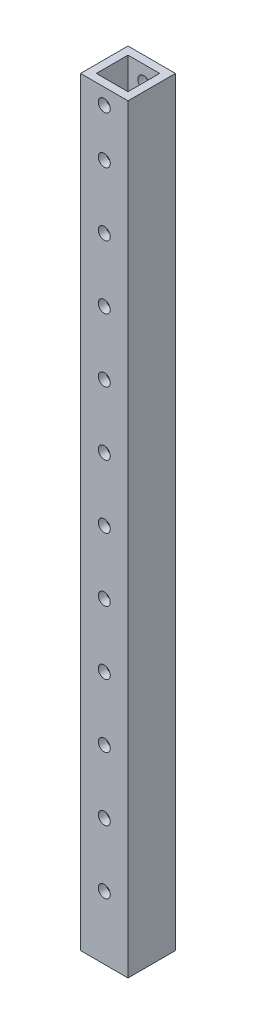
ISO-10303-21;
HEADER;
FILE_DESCRIPTION(('STEP AP214'),'2;1');
FILE_NAME('part.step','',(''),(''),'','','');
FILE_SCHEMA(('AUTOMOTIVE_DESIGN { 1 0 10303 214 1 1 1 1 }'));
ENDSEC;
DATA;
#1=APPLICATION_CONTEXT('core data for automotive mechanical design processes');
#2=APPLICATION_PROTOCOL_DEFINITION('international standard','automotive_design',2000,#1);
#3=PRODUCT_CONTEXT('',#1,'mechanical');
#4=PRODUCT('Part','Part','',(#3));
#5=PRODUCT_RELATED_PRODUCT_CATEGORY('part','',(#4));
#6=PRODUCT_DEFINITION_FORMATION('','',#4);
#7=PRODUCT_DEFINITION_CONTEXT('part definition',#1,'design');
#8=PRODUCT_DEFINITION('design','',#6,#7);
#9=PRODUCT_DEFINITION_SHAPE('','',#8);
#10=(LENGTH_UNIT() NAMED_UNIT(*) SI_UNIT(.MILLI.,.METRE.));
#11=(NAMED_UNIT(*) PLANE_ANGLE_UNIT() SI_UNIT($,.RADIAN.));
#12=(NAMED_UNIT(*) SI_UNIT($,.STERADIAN.) SOLID_ANGLE_UNIT());
#13=UNCERTAINTY_MEASURE_WITH_UNIT(LENGTH_MEASURE(1.E-05),#10,'distance_accuracy_value','');
#14=(GEOMETRIC_REPRESENTATION_CONTEXT(3) GLOBAL_UNCERTAINTY_ASSIGNED_CONTEXT((#13)) GLOBAL_UNIT_ASSIGNED_CONTEXT((#10,
#11,#12)) REPRESENTATION_CONTEXT('',''));
#15=CARTESIAN_POINT('',(0.,0.,0.));
#16=DIRECTION('',(0.,0.,1.));
#17=DIRECTION('',(1.,0.,0.));
#18=AXIS2_PLACEMENT_3D('',#15,#16,#17);
#19=CARTESIAN_POINT('',(0.,609.6,0.));
#20=DIRECTION('',(0.,-1.,0.));
#21=DIRECTION('',(0.,0.,-1.));
#22=AXIS2_PLACEMENT_3D('',#19,#20,#21);
#23=PLANE('',#22);
#24=DIRECTION('',(0.,0.,-1.));
#25=VECTOR('',#24,1.);
#26=CARTESIAN_POINT('',(19.05,609.6,19.05));
#27=LINE('',#26,#25);
#28=CARTESIAN_POINT('',(19.05,609.6,19.05));
#29=VERTEX_POINT('',#28);
#30=CARTESIAN_POINT('',(19.05,609.6,-19.05));
#31=VERTEX_POINT('',#30);
#32=EDGE_CURVE('E138',#29,#31,#27,.T.);
#33=ORIENTED_EDGE('',*,*,#32,.T.);
#34=DIRECTION('',(-1.,0.,0.));
#35=VECTOR('',#34,1.);
#36=CARTESIAN_POINT('',(-19.05,609.6,-19.05));
#37=LINE('',#36,#35);
#38=CARTESIAN_POINT('',(-19.05,609.6,-19.05));
#39=VERTEX_POINT('',#38);
#40=EDGE_CURVE('E141',#31,#39,#37,.T.);
#41=ORIENTED_EDGE('',*,*,#40,.T.);
#42=DIRECTION('',(0.,0.,1.));
#43=VECTOR('',#42,1.);
#44=CARTESIAN_POINT('',(-19.05,609.6,19.05));
#45=LINE('',#44,#43);
#46=CARTESIAN_POINT('',(-19.05,609.6,19.05));
#47=VERTEX_POINT('',#46);
#48=EDGE_CURVE('E144',#39,#47,#45,.T.);
#49=ORIENTED_EDGE('',*,*,#48,.T.);
#50=DIRECTION('',(1.,0.,0.));
#51=VECTOR('',#50,1.);
#52=CARTESIAN_POINT('',(-19.05,609.6,19.05));
#53=LINE('',#52,#51);
#54=EDGE_CURVE('E146',#47,#29,#53,.T.);
#55=ORIENTED_EDGE('',*,*,#54,.T.);
#56=EDGE_LOOP('',(#33,#41,#49,#55));
#57=FACE_BOUND('',#56,.T.);
#58=DIRECTION('',(0.,0.,-1.));
#59=VECTOR('',#58,1.);
#60=CARTESIAN_POINT('',(12.7,609.6,12.7));
#61=LINE('',#60,#59);
#62=CARTESIAN_POINT('',(12.7,609.6,12.7));
#63=VERTEX_POINT('',#62);
#64=CARTESIAN_POINT('',(12.7,609.6,-12.7));
#65=VERTEX_POINT('',#64);
#66=EDGE_CURVE('E100',#63,#65,#61,.T.);
#67=ORIENTED_EDGE('',*,*,#66,.F.);
#68=DIRECTION('',(1.,0.,0.));
#69=VECTOR('',#68,1.);
#70=CARTESIAN_POINT('',(-12.7,609.6,12.7));
#71=LINE('',#70,#69);
#72=CARTESIAN_POINT('',(-12.7,609.6,12.7));
#73=VERTEX_POINT('',#72);
#74=EDGE_CURVE('E122',#73,#63,#71,.T.);
#75=ORIENTED_EDGE('',*,*,#74,.F.);
#76=DIRECTION('',(0.,0.,1.));
#77=VECTOR('',#76,1.);
#78=CARTESIAN_POINT('',(-12.7,609.6,12.7));
#79=LINE('',#78,#77);
#80=CARTESIAN_POINT('',(-12.7,609.6,-12.7));
#81=VERTEX_POINT('',#80);
#82=EDGE_CURVE('E120',#81,#73,#79,.T.);
#83=ORIENTED_EDGE('',*,*,#82,.F.);
#84=DIRECTION('',(-1.,0.,0.));
#85=VECTOR('',#84,1.);
#86=CARTESIAN_POINT('',(-12.7,609.6,-12.7));
#87=LINE('',#86,#85);
#88=EDGE_CURVE('E108',#65,#81,#87,.T.);
#89=ORIENTED_EDGE('',*,*,#88,.F.);
#90=EDGE_LOOP('',(#67,#75,#83,#89));
#91=FACE_BOUND('',#90,.T.);
#92=ADVANCED_FACE('F33',(#57,#91),#23,.F.);
#93=CARTESIAN_POINT('',(0.,0.,0.));
#94=DIRECTION('',(0.,-1.,0.));
#95=DIRECTION('',(0.,0.,-1.));
#96=AXIS2_PLACEMENT_3D('',#93,#94,#95);
#97=PLANE('',#96);
#98=DIRECTION('',(0.,0.,-1.));
#99=VECTOR('',#98,1.);
#100=CARTESIAN_POINT('',(19.05,0.,19.05));
#101=LINE('',#100,#99);
#102=CARTESIAN_POINT('',(19.05,0.,19.05));
#103=VERTEX_POINT('',#102);
#104=CARTESIAN_POINT('',(19.05,0.,-19.05));
#105=VERTEX_POINT('',#104);
#106=EDGE_CURVE('E116',#103,#105,#101,.T.);
#107=ORIENTED_EDGE('',*,*,#106,.F.);
#108=DIRECTION('',(1.,0.,0.));
#109=VECTOR('',#108,1.);
#110=CARTESIAN_POINT('',(-19.05,0.,19.05));
#111=LINE('',#110,#109);
#112=CARTESIAN_POINT('',(-19.05,0.,19.05));
#113=VERTEX_POINT('',#112);
#114=EDGE_CURVE('E142',#113,#103,#111,.T.);
#115=ORIENTED_EDGE('',*,*,#114,.F.);
#116=DIRECTION('',(0.,0.,1.));
#117=VECTOR('',#116,1.);
#118=CARTESIAN_POINT('',(-19.05,0.,19.05));
#119=LINE('',#118,#117);
#120=CARTESIAN_POINT('',(-19.05,0.,-19.05));
#121=VERTEX_POINT('',#120);
#122=EDGE_CURVE('E153',#121,#113,#119,.T.);
#123=ORIENTED_EDGE('',*,*,#122,.F.);
#124=DIRECTION('',(-1.,0.,0.));
#125=VECTOR('',#124,1.);
#126=CARTESIAN_POINT('',(-19.05,0.,-19.05));
#127=LINE('',#126,#125);
#128=EDGE_CURVE('E151',#105,#121,#127,.T.);
#129=ORIENTED_EDGE('',*,*,#128,.F.);
#130=EDGE_LOOP('',(#107,#115,#123,#129));
#131=FACE_BOUND('',#130,.T.);
#132=DIRECTION('',(1.,0.,0.));
#133=VECTOR('',#132,1.);
#134=CARTESIAN_POINT('',(-12.7,0.,12.7));
#135=LINE('',#134,#133);
#136=CARTESIAN_POINT('',(-12.7,0.,12.7));
#137=VERTEX_POINT('',#136);
#138=CARTESIAN_POINT('',(12.7,0.,12.7));
#139=VERTEX_POINT('',#138);
#140=EDGE_CURVE('E109',#137,#139,#135,.T.);
#141=ORIENTED_EDGE('',*,*,#140,.T.);
#142=DIRECTION('',(0.,0.,-1.));
#143=VECTOR('',#142,1.);
#144=CARTESIAN_POINT('',(12.7,0.,12.7));
#145=LINE('',#144,#143);
#146=CARTESIAN_POINT('',(12.7,0.,-12.7));
#147=VERTEX_POINT('',#146);
#148=EDGE_CURVE('E58',#139,#147,#145,.T.);
#149=ORIENTED_EDGE('',*,*,#148,.T.);
#150=DIRECTION('',(-1.,0.,0.));
#151=VECTOR('',#150,1.);
#152=CARTESIAN_POINT('',(-12.7,0.,-12.7));
#153=LINE('',#152,#151);
#154=CARTESIAN_POINT('',(-12.7,0.,-12.7));
#155=VERTEX_POINT('',#154);
#156=EDGE_CURVE('E115',#147,#155,#153,.T.);
#157=ORIENTED_EDGE('',*,*,#156,.T.);
#158=DIRECTION('',(0.,0.,1.));
#159=VECTOR('',#158,1.);
#160=CARTESIAN_POINT('',(-12.7,0.,12.7));
#161=LINE('',#160,#159);
#162=EDGE_CURVE('E130',#155,#137,#161,.T.);
#163=ORIENTED_EDGE('',*,*,#162,.T.);
#164=EDGE_LOOP('',(#141,#149,#157,#163));
#165=FACE_BOUND('',#164,.T.);
#166=ADVANCED_FACE('F256',(#131,#165),#97,.T.);
#167=CARTESIAN_POINT('',(19.05,609.6,19.05));
#168=DIRECTION('',(-1.,0.,0.));
#169=DIRECTION('',(0.,0.,1.));
#170=AXIS2_PLACEMENT_3D('',#167,#168,#169);
#171=PLANE('',#170);
#172=ORIENTED_EDGE('',*,*,#106,.T.);
#173=DIRECTION('',(0.,-1.,0.));
#174=VECTOR('',#173,1.);
#175=CARTESIAN_POINT('',(19.05,609.6,-19.05));
#176=LINE('',#175,#174);
#177=EDGE_CURVE('E11',#31,#105,#176,.T.);
#178=ORIENTED_EDGE('',*,*,#177,.F.);
#179=ORIENTED_EDGE('',*,*,#32,.F.);
#180=DIRECTION('',(0.,-1.,0.));
#181=VECTOR('',#180,1.);
#182=CARTESIAN_POINT('',(19.05,609.6,19.05));
#183=LINE('',#182,#181);
#184=EDGE_CURVE('E148',#29,#103,#183,.T.);
#185=ORIENTED_EDGE('',*,*,#184,.T.);
#186=EDGE_LOOP('',(#172,#178,#179,#185));
#187=FACE_BOUND('',#186,.T.);
#188=ADVANCED_FACE('F35',(#187),#171,.F.);
#189=CARTESIAN_POINT('',(-19.05,609.6,-19.05));
#190=DIRECTION('',(0.,0.,1.));
#191=DIRECTION('',(1.,0.,0.));
#192=AXIS2_PLACEMENT_3D('',#189,#190,#191);
#193=PLANE('',#192);
#194=CARTESIAN_POINT('',(0.,596.9,-19.05));
#195=DIRECTION('',(0.,0.,1.));
#196=DIRECTION('',(1.,0.,0.));
#197=AXIS2_PLACEMENT_3D('',#194,#195,#196);
#198=CIRCLE('',#197,4.82600000000001);
#199=CARTESIAN_POINT('',(4.82600000000001,596.9,-19.05));
#200=VERTEX_POINT('',#199);
#201=EDGE_CURVE('E128',#200,#200,#198,.T.);
#202=ORIENTED_EDGE('',*,*,#201,.T.);
#203=EDGE_LOOP('',(#202));
#204=FACE_BOUND('',#203,.T.);
#205=CARTESIAN_POINT('',(0.,558.8,-19.05));
#206=DIRECTION('',(0.,0.,1.));
#207=DIRECTION('',(1.,0.,0.));
#208=AXIS2_PLACEMENT_3D('',#205,#206,#207);
#209=CIRCLE('',#208,4.82600000000001);
#210=CARTESIAN_POINT('',(4.82600000000001,558.8,-19.05));
#211=VERTEX_POINT('',#210);
#212=EDGE_CURVE('E219',#211,#211,#209,.T.);
#213=ORIENTED_EDGE('',*,*,#212,.T.);
#214=EDGE_LOOP('',(#213));
#215=FACE_BOUND('',#214,.T.);
#216=CARTESIAN_POINT('',(5.28991153169859E-13,508.,-19.05));
#217=DIRECTION('',(0.,0.,1.));
#218=DIRECTION('',(1.,0.,0.));
#219=AXIS2_PLACEMENT_3D('',#216,#217,#218);
#220=CIRCLE('',#219,4.82600000000001);
#221=CARTESIAN_POINT('',(4.82600000000054,508.,-19.05));
#222=VERTEX_POINT('',#221);
#223=EDGE_CURVE('E215',#222,#222,#220,.T.);
#224=ORIENTED_EDGE('',*,*,#223,.T.);
#225=EDGE_LOOP('',(#224));
#226=FACE_BOUND('',#225,.T.);
#227=CARTESIAN_POINT('',(1.05798230633972E-12,457.2,-19.05));
#228=DIRECTION('',(0.,0.,1.));
#229=DIRECTION('',(1.,0.,0.));
#230=AXIS2_PLACEMENT_3D('',#227,#228,#229);
#231=CIRCLE('',#230,4.82600000000001);
#232=CARTESIAN_POINT('',(4.82600000000107,457.2,-19.05));
#233=VERTEX_POINT('',#232);
#234=EDGE_CURVE('E211',#233,#233,#231,.T.);
#235=ORIENTED_EDGE('',*,*,#234,.T.);
#236=EDGE_LOOP('',(#235));
#237=FACE_BOUND('',#236,.T.);
#238=CARTESIAN_POINT('',(1.58697345950958E-12,406.4,-19.05));
#239=DIRECTION('',(0.,0.,1.));
#240=DIRECTION('',(1.,0.,0.));
#241=AXIS2_PLACEMENT_3D('',#238,#239,#240);
#242=CIRCLE('',#241,4.82600000000001);
#243=CARTESIAN_POINT('',(4.8260000000016,406.4,-19.05));
#244=VERTEX_POINT('',#243);
#245=EDGE_CURVE('E207',#244,#244,#242,.T.);
#246=ORIENTED_EDGE('',*,*,#245,.T.);
#247=EDGE_LOOP('',(#246));
#248=FACE_BOUND('',#247,.T.);
#249=CARTESIAN_POINT('',(2.11596461267944E-12,355.6,-19.05));
#250=DIRECTION('',(0.,0.,1.));
#251=DIRECTION('',(1.,0.,0.));
#252=AXIS2_PLACEMENT_3D('',#249,#250,#251);
#253=CIRCLE('',#252,4.82600000000001);
#254=CARTESIAN_POINT('',(4.82600000000213,355.6,-19.05));
#255=VERTEX_POINT('',#254);
#256=EDGE_CURVE('E202',#255,#255,#253,.T.);
#257=ORIENTED_EDGE('',*,*,#256,.T.);
#258=EDGE_LOOP('',(#257));
#259=FACE_BOUND('',#258,.T.);
#260=CARTESIAN_POINT('',(2.6449557658493E-12,304.8,-19.05));
#261=DIRECTION('',(0.,0.,1.));
#262=DIRECTION('',(1.,0.,0.));
#263=AXIS2_PLACEMENT_3D('',#260,#261,#262);
#264=CIRCLE('',#263,4.82600000000001);
#265=CARTESIAN_POINT('',(4.82600000000266,304.8,-19.05));
#266=VERTEX_POINT('',#265);
#267=EDGE_CURVE('E197',#266,#266,#264,.T.);
#268=ORIENTED_EDGE('',*,*,#267,.T.);
#269=EDGE_LOOP('',(#268));
#270=FACE_BOUND('',#269,.T.);
#271=CARTESIAN_POINT('',(3.17394691901916E-12,254.,-19.05));
#272=DIRECTION('',(0.,0.,1.));
#273=DIRECTION('',(1.,0.,0.));
#274=AXIS2_PLACEMENT_3D('',#271,#272,#273);
#275=CIRCLE('',#274,4.82600000000001);
#276=CARTESIAN_POINT('',(4.82600000000319,254.,-19.05));
#277=VERTEX_POINT('',#276);
#278=EDGE_CURVE('E192',#277,#277,#275,.T.);
#279=ORIENTED_EDGE('',*,*,#278,.T.);
#280=EDGE_LOOP('',(#279));
#281=FACE_BOUND('',#280,.T.);
#282=CARTESIAN_POINT('',(3.70293807218901E-12,203.2,-19.05));
#283=DIRECTION('',(0.,0.,1.));
#284=DIRECTION('',(1.,0.,0.));
#285=AXIS2_PLACEMENT_3D('',#282,#283,#284);
#286=CIRCLE('',#285,4.82600000000001);
#287=CARTESIAN_POINT('',(4.82600000000371,203.2,-19.05));
#288=VERTEX_POINT('',#287);
#289=EDGE_CURVE('E187',#288,#288,#286,.T.);
#290=ORIENTED_EDGE('',*,*,#289,.T.);
#291=EDGE_LOOP('',(#290));
#292=FACE_BOUND('',#291,.T.);
#293=CARTESIAN_POINT('',(4.23192922535887E-12,152.4,-19.05));
#294=DIRECTION('',(0.,0.,1.));
#295=DIRECTION('',(1.,0.,0.));
#296=AXIS2_PLACEMENT_3D('',#293,#294,#295);
#297=CIRCLE('',#296,4.82600000000001);
#298=CARTESIAN_POINT('',(4.82600000000424,152.4,-19.05));
#299=VERTEX_POINT('',#298);
#300=EDGE_CURVE('E182',#299,#299,#297,.T.);
#301=ORIENTED_EDGE('',*,*,#300,.T.);
#302=EDGE_LOOP('',(#301));
#303=FACE_BOUND('',#302,.T.);
#304=CARTESIAN_POINT('',(4.76092037852873E-12,101.6,-19.05));
#305=DIRECTION('',(0.,0.,1.));
#306=DIRECTION('',(1.,0.,0.));
#307=AXIS2_PLACEMENT_3D('',#304,#305,#306);
#308=CIRCLE('',#307,4.82600000000001);
#309=CARTESIAN_POINT('',(4.82600000000477,101.6,-19.05));
#310=VERTEX_POINT('',#309);
#311=EDGE_CURVE('E177',#310,#310,#308,.T.);
#312=ORIENTED_EDGE('',*,*,#311,.T.);
#313=EDGE_LOOP('',(#312));
#314=FACE_BOUND('',#313,.T.);
#315=CARTESIAN_POINT('',(5.28991153169859E-12,50.8000000000001,-19.05));
#316=DIRECTION('',(0.,0.,1.));
#317=DIRECTION('',(1.,0.,0.));
#318=AXIS2_PLACEMENT_3D('',#315,#316,#317);
#319=CIRCLE('',#318,4.82600000000001);
#320=CARTESIAN_POINT('',(4.8260000000053,50.8000000000001,-19.05));
#321=VERTEX_POINT('',#320);
#322=EDGE_CURVE('E172',#321,#321,#319,.T.);
#323=ORIENTED_EDGE('',*,*,#322,.T.);
#324=EDGE_LOOP('',(#323));
#325=FACE_BOUND('',#324,.T.);
#326=ORIENTED_EDGE('',*,*,#128,.T.);
#327=DIRECTION('',(0.,-1.,0.));
#328=VECTOR('',#327,1.);
#329=CARTESIAN_POINT('',(-19.05,609.6,-19.05));
#330=LINE('',#329,#328);
#331=EDGE_CURVE('E42',#39,#121,#330,.T.);
#332=ORIENTED_EDGE('',*,*,#331,.F.);
#333=ORIENTED_EDGE('',*,*,#40,.F.);
#334=ORIENTED_EDGE('',*,*,#177,.T.);
#335=EDGE_LOOP('',(#326,#332,#333,#334));
#336=FACE_BOUND('',#335,.T.);
#337=ADVANCED_FACE('F236',(#204,#215,#226,#237,#248,#259,#270,#281,#292,#303,#314,#325,#336),
#193,.F.);
#338=CARTESIAN_POINT('',(-19.05,609.6,19.05));
#339=DIRECTION('',(1.,0.,0.));
#340=DIRECTION('',(0.,0.,-1.));
#341=AXIS2_PLACEMENT_3D('',#338,#339,#340);
#342=PLANE('',#341);
#343=ORIENTED_EDGE('',*,*,#122,.T.);
#344=DIRECTION('',(0.,-1.,0.));
#345=VECTOR('',#344,1.);
#346=CARTESIAN_POINT('',(-19.05,609.6,19.05));
#347=LINE('',#346,#345);
#348=EDGE_CURVE('E158',#47,#113,#347,.T.);
#349=ORIENTED_EDGE('',*,*,#348,.F.);
#350=ORIENTED_EDGE('',*,*,#48,.F.);
#351=ORIENTED_EDGE('',*,*,#331,.T.);
#352=EDGE_LOOP('',(#343,#349,#350,#351));
#353=FACE_BOUND('',#352,.T.);
#354=ADVANCED_FACE('F270',(#353),#342,.F.);
#355=CARTESIAN_POINT('',(-19.05,609.6,19.05));
#356=DIRECTION('',(0.,0.,-1.));
#357=DIRECTION('',(-1.,0.,0.));
#358=AXIS2_PLACEMENT_3D('',#355,#356,#357);
#359=PLANE('',#358);
#360=CARTESIAN_POINT('',(0.,596.9,19.05));
#361=DIRECTION('',(0.,0.,1.));
#362=DIRECTION('',(1.,0.,0.));
#363=AXIS2_PLACEMENT_3D('',#360,#361,#362);
#364=CIRCLE('',#363,4.82600000000001);
#365=CARTESIAN_POINT('',(4.82600000000001,596.9,19.05));
#366=VERTEX_POINT('',#365);
#367=EDGE_CURVE('E167',#366,#366,#364,.T.);
#368=ORIENTED_EDGE('',*,*,#367,.F.);
#369=EDGE_LOOP('',(#368));
#370=FACE_BOUND('',#369,.T.);
#371=CARTESIAN_POINT('',(0.,558.8,19.05));
#372=DIRECTION('',(0.,0.,1.));
#373=DIRECTION('',(1.,0.,0.));
#374=AXIS2_PLACEMENT_3D('',#371,#372,#373);
#375=CIRCLE('',#374,4.82600000000001);
#376=CARTESIAN_POINT('',(4.82600000000001,558.8,19.05));
#377=VERTEX_POINT('',#376);
#378=EDGE_CURVE('E420',#377,#377,#375,.T.);
#379=ORIENTED_EDGE('',*,*,#378,.F.);
#380=EDGE_LOOP('',(#379));
#381=FACE_BOUND('',#380,.T.);
#382=CARTESIAN_POINT('',(5.28991153169859E-13,508.,19.05));
#383=DIRECTION('',(0.,0.,1.));
#384=DIRECTION('',(1.,0.,0.));
#385=AXIS2_PLACEMENT_3D('',#382,#383,#384);
#386=CIRCLE('',#385,4.82600000000001);
#387=CARTESIAN_POINT('',(4.82600000000054,508.,19.05));
#388=VERTEX_POINT('',#387);
#389=EDGE_CURVE('E416',#388,#388,#386,.T.);
#390=ORIENTED_EDGE('',*,*,#389,.F.);
#391=EDGE_LOOP('',(#390));
#392=FACE_BOUND('',#391,.T.);
#393=CARTESIAN_POINT('',(1.05798230633972E-12,457.2,19.05));
#394=DIRECTION('',(0.,0.,1.));
#395=DIRECTION('',(1.,0.,0.));
#396=AXIS2_PLACEMENT_3D('',#393,#394,#395);
#397=CIRCLE('',#396,4.82600000000001);
#398=CARTESIAN_POINT('',(4.82600000000107,457.2,19.05));
#399=VERTEX_POINT('',#398);
#400=EDGE_CURVE('E414',#399,#399,#397,.T.);
#401=ORIENTED_EDGE('',*,*,#400,.F.);
#402=EDGE_LOOP('',(#401));
#403=FACE_BOUND('',#402,.T.);
#404=CARTESIAN_POINT('',(1.58697345950958E-12,406.4,19.05));
#405=DIRECTION('',(0.,0.,1.));
#406=DIRECTION('',(1.,0.,0.));
#407=AXIS2_PLACEMENT_3D('',#404,#405,#406);
#408=CIRCLE('',#407,4.82600000000001);
#409=CARTESIAN_POINT('',(4.8260000000016,406.4,19.05));
#410=VERTEX_POINT('',#409);
#411=EDGE_CURVE('E417',#410,#410,#408,.T.);
#412=ORIENTED_EDGE('',*,*,#411,.F.);
#413=EDGE_LOOP('',(#412));
#414=FACE_BOUND('',#413,.T.);
#415=CARTESIAN_POINT('',(2.11596461267944E-12,355.6,19.05));
#416=DIRECTION('',(0.,0.,1.));
#417=DIRECTION('',(1.,0.,0.));
#418=AXIS2_PLACEMENT_3D('',#415,#416,#417);
#419=CIRCLE('',#418,4.82600000000001);
#420=CARTESIAN_POINT('',(4.82600000000213,355.6,19.05));
#421=VERTEX_POINT('',#420);
#422=EDGE_CURVE('E423',#421,#421,#419,.T.);
#423=ORIENTED_EDGE('',*,*,#422,.F.);
#424=EDGE_LOOP('',(#423));
#425=FACE_BOUND('',#424,.T.);
#426=CARTESIAN_POINT('',(2.6449557658493E-12,304.8,19.05));
#427=DIRECTION('',(0.,0.,1.));
#428=DIRECTION('',(1.,0.,0.));
#429=AXIS2_PLACEMENT_3D('',#426,#427,#428);
#430=CIRCLE('',#429,4.82600000000001);
#431=CARTESIAN_POINT('',(4.82600000000266,304.8,19.05));
#432=VERTEX_POINT('',#431);
#433=EDGE_CURVE('E429',#432,#432,#430,.T.);
#434=ORIENTED_EDGE('',*,*,#433,.F.);
#435=EDGE_LOOP('',(#434));
#436=FACE_BOUND('',#435,.T.);
#437=CARTESIAN_POINT('',(3.17394691901916E-12,254.,19.05));
#438=DIRECTION('',(0.,0.,1.));
#439=DIRECTION('',(1.,0.,0.));
#440=AXIS2_PLACEMENT_3D('',#437,#438,#439);
#441=CIRCLE('',#440,4.82600000000001);
#442=CARTESIAN_POINT('',(4.82600000000319,254.,19.05));
#443=VERTEX_POINT('',#442);
#444=EDGE_CURVE('E432',#443,#443,#441,.T.);
#445=ORIENTED_EDGE('',*,*,#444,.F.);
#446=EDGE_LOOP('',(#445));
#447=FACE_BOUND('',#446,.T.);
#448=CARTESIAN_POINT('',(3.70293807218901E-12,203.2,19.05));
#449=DIRECTION('',(0.,0.,1.));
#450=DIRECTION('',(1.,0.,0.));
#451=AXIS2_PLACEMENT_3D('',#448,#449,#450);
#452=CIRCLE('',#451,4.82600000000001);
#453=CARTESIAN_POINT('',(4.82600000000371,203.2,19.05));
#454=VERTEX_POINT('',#453);
#455=EDGE_CURVE('E435',#454,#454,#452,.T.);
#456=ORIENTED_EDGE('',*,*,#455,.F.);
#457=EDGE_LOOP('',(#456));
#458=FACE_BOUND('',#457,.T.);
#459=CARTESIAN_POINT('',(4.23192922535887E-12,152.4,19.05));
#460=DIRECTION('',(0.,0.,1.));
#461=DIRECTION('',(1.,0.,0.));
#462=AXIS2_PLACEMENT_3D('',#459,#460,#461);
#463=CIRCLE('',#462,4.82600000000001);
#464=CARTESIAN_POINT('',(4.82600000000424,152.4,19.05));
#465=VERTEX_POINT('',#464);
#466=EDGE_CURVE('E438',#465,#465,#463,.T.);
#467=ORIENTED_EDGE('',*,*,#466,.F.);
#468=EDGE_LOOP('',(#467));
#469=FACE_BOUND('',#468,.T.);
#470=CARTESIAN_POINT('',(4.76092037852873E-12,101.6,19.05));
#471=DIRECTION('',(0.,0.,1.));
#472=DIRECTION('',(1.,0.,0.));
#473=AXIS2_PLACEMENT_3D('',#470,#471,#472);
#474=CIRCLE('',#473,4.82600000000001);
#475=CARTESIAN_POINT('',(4.82600000000477,101.6,19.05));
#476=VERTEX_POINT('',#475);
#477=EDGE_CURVE('E440',#476,#476,#474,.T.);
#478=ORIENTED_EDGE('',*,*,#477,.F.);
#479=EDGE_LOOP('',(#478));
#480=FACE_BOUND('',#479,.T.);
#481=CARTESIAN_POINT('',(5.28991153169859E-12,50.8000000000001,19.05));
#482=DIRECTION('',(0.,0.,1.));
#483=DIRECTION('',(1.,0.,0.));
#484=AXIS2_PLACEMENT_3D('',#481,#482,#483);
#485=CIRCLE('',#484,4.82600000000001);
#486=CARTESIAN_POINT('',(4.8260000000053,50.8000000000001,19.05));
#487=VERTEX_POINT('',#486);
#488=EDGE_CURVE('E355',#487,#487,#485,.T.);
#489=ORIENTED_EDGE('',*,*,#488,.F.);
#490=EDGE_LOOP('',(#489));
#491=FACE_BOUND('',#490,.T.);
#492=ORIENTED_EDGE('',*,*,#114,.T.);
#493=ORIENTED_EDGE('',*,*,#184,.F.);
#494=ORIENTED_EDGE('',*,*,#54,.F.);
#495=ORIENTED_EDGE('',*,*,#348,.T.);
#496=EDGE_LOOP('',(#492,#493,#494,#495));
#497=FACE_BOUND('',#496,.T.);
#498=ADVANCED_FACE('F267',(#370,#381,#392,#403,#414,#425,#436,#447,#458,#469,#480,#491,#497),
#359,.F.);
#499=CARTESIAN_POINT('',(12.7,609.6,12.7));
#500=DIRECTION('',(-1.,0.,0.));
#501=DIRECTION('',(0.,0.,1.));
#502=AXIS2_PLACEMENT_3D('',#499,#500,#501);
#503=PLANE('',#502);
#504=ORIENTED_EDGE('',*,*,#148,.F.);
#505=DIRECTION('',(0.,-1.,0.));
#506=VECTOR('',#505,1.);
#507=CARTESIAN_POINT('',(12.7,609.6,12.7));
#508=LINE('',#507,#506);
#509=EDGE_CURVE('E104',#63,#139,#508,.T.);
#510=ORIENTED_EDGE('',*,*,#509,.F.);
#511=ORIENTED_EDGE('',*,*,#66,.T.);
#512=DIRECTION('',(0.,-1.,0.));
#513=VECTOR('',#512,1.);
#514=CARTESIAN_POINT('',(12.7,609.6,-12.7));
#515=LINE('',#514,#513);
#516=EDGE_CURVE('E103',#65,#147,#515,.T.);
#517=ORIENTED_EDGE('',*,*,#516,.T.);
#518=EDGE_LOOP('',(#504,#510,#511,#517));
#519=FACE_BOUND('',#518,.T.);
#520=ADVANCED_FACE('F102',(#519),#503,.T.);
#521=CARTESIAN_POINT('',(-12.7,609.6,-12.7));
#522=DIRECTION('',(0.,0.,1.));
#523=DIRECTION('',(1.,0.,0.));
#524=AXIS2_PLACEMENT_3D('',#521,#522,#523);
#525=PLANE('',#524);
#526=CARTESIAN_POINT('',(0.,596.9,-12.7000000000002));
#527=DIRECTION('',(0.,0.,1.));
#528=DIRECTION('',(1.,0.,0.));
#529=AXIS2_PLACEMENT_3D('',#526,#527,#528);
#530=CIRCLE('',#529,4.82600000000001);
#531=CARTESIAN_POINT('',(4.82600000000001,596.9,-12.7000000000002));
#532=VERTEX_POINT('',#531);
#533=EDGE_CURVE('E231',#532,#532,#530,.T.);
#534=ORIENTED_EDGE('',*,*,#533,.F.);
#535=EDGE_LOOP('',(#534));
#536=FACE_BOUND('',#535,.T.);
#537=CARTESIAN_POINT('',(0.,558.8,-12.7000000000002));
#538=DIRECTION('',(0.,0.,1.));
#539=DIRECTION('',(1.,0.,0.));
#540=AXIS2_PLACEMENT_3D('',#537,#538,#539);
#541=CIRCLE('',#540,4.82600000000001);
#542=CARTESIAN_POINT('',(4.82600000000001,558.8,-12.7000000000002));
#543=VERTEX_POINT('',#542);
#544=EDGE_CURVE('E214',#543,#543,#541,.T.);
#545=ORIENTED_EDGE('',*,*,#544,.F.);
#546=EDGE_LOOP('',(#545));
#547=FACE_BOUND('',#546,.T.);
#548=CARTESIAN_POINT('',(5.28991153169859E-13,508.,-12.7000000000002));
#549=DIRECTION('',(0.,0.,1.));
#550=DIRECTION('',(1.,0.,0.));
#551=AXIS2_PLACEMENT_3D('',#548,#549,#550);
#552=CIRCLE('',#551,4.82600000000001);
#553=CARTESIAN_POINT('',(4.82600000000054,508.,-12.7000000000002));
#554=VERTEX_POINT('',#553);
#555=EDGE_CURVE('E210',#554,#554,#552,.T.);
#556=ORIENTED_EDGE('',*,*,#555,.F.);
#557=EDGE_LOOP('',(#556));
#558=FACE_BOUND('',#557,.T.);
#559=CARTESIAN_POINT('',(1.05798230633972E-12,457.2,-12.7000000000002));
#560=DIRECTION('',(0.,0.,1.));
#561=DIRECTION('',(1.,0.,0.));
#562=AXIS2_PLACEMENT_3D('',#559,#560,#561);
#563=CIRCLE('',#562,4.82600000000001);
#564=CARTESIAN_POINT('',(4.82600000000107,457.2,-12.7000000000002));
#565=VERTEX_POINT('',#564);
#566=EDGE_CURVE('E206',#565,#565,#563,.T.);
#567=ORIENTED_EDGE('',*,*,#566,.F.);
#568=EDGE_LOOP('',(#567));
#569=FACE_BOUND('',#568,.T.);
#570=CARTESIAN_POINT('',(1.58697345950958E-12,406.4,-12.7000000000002));
#571=DIRECTION('',(0.,0.,1.));
#572=DIRECTION('',(1.,0.,0.));
#573=AXIS2_PLACEMENT_3D('',#570,#571,#572);
#574=CIRCLE('',#573,4.82600000000001);
#575=CARTESIAN_POINT('',(4.8260000000016,406.4,-12.7000000000002));
#576=VERTEX_POINT('',#575);
#577=EDGE_CURVE('E201',#576,#576,#574,.T.);
#578=ORIENTED_EDGE('',*,*,#577,.F.);
#579=EDGE_LOOP('',(#578));
#580=FACE_BOUND('',#579,.T.);
#581=CARTESIAN_POINT('',(2.11596461267944E-12,355.6,-12.7000000000002));
#582=DIRECTION('',(0.,0.,1.));
#583=DIRECTION('',(1.,0.,0.));
#584=AXIS2_PLACEMENT_3D('',#581,#582,#583);
#585=CIRCLE('',#584,4.82600000000001);
#586=CARTESIAN_POINT('',(4.82600000000213,355.6,-12.7000000000002));
#587=VERTEX_POINT('',#586);
#588=EDGE_CURVE('E196',#587,#587,#585,.T.);
#589=ORIENTED_EDGE('',*,*,#588,.F.);
#590=EDGE_LOOP('',(#589));
#591=FACE_BOUND('',#590,.T.);
#592=CARTESIAN_POINT('',(2.6449557658493E-12,304.8,-12.7000000000002));
#593=DIRECTION('',(0.,0.,1.));
#594=DIRECTION('',(1.,0.,0.));
#595=AXIS2_PLACEMENT_3D('',#592,#593,#594);
#596=CIRCLE('',#595,4.82600000000001);
#597=CARTESIAN_POINT('',(4.82600000000266,304.8,-12.7000000000002));
#598=VERTEX_POINT('',#597);
#599=EDGE_CURVE('E191',#598,#598,#596,.T.);
#600=ORIENTED_EDGE('',*,*,#599,.F.);
#601=EDGE_LOOP('',(#600));
#602=FACE_BOUND('',#601,.T.);
#603=CARTESIAN_POINT('',(3.17394691901916E-12,254.,-12.7000000000002));
#604=DIRECTION('',(0.,0.,1.));
#605=DIRECTION('',(1.,0.,0.));
#606=AXIS2_PLACEMENT_3D('',#603,#604,#605);
#607=CIRCLE('',#606,4.82600000000001);
#608=CARTESIAN_POINT('',(4.82600000000319,254.,-12.7000000000002));
#609=VERTEX_POINT('',#608);
#610=EDGE_CURVE('E186',#609,#609,#607,.T.);
#611=ORIENTED_EDGE('',*,*,#610,.F.);
#612=EDGE_LOOP('',(#611));
#613=FACE_BOUND('',#612,.T.);
#614=CARTESIAN_POINT('',(3.70293807218901E-12,203.2,-12.7000000000002));
#615=DIRECTION('',(0.,0.,1.));
#616=DIRECTION('',(1.,0.,0.));
#617=AXIS2_PLACEMENT_3D('',#614,#615,#616);
#618=CIRCLE('',#617,4.82600000000001);
#619=CARTESIAN_POINT('',(4.82600000000371,203.2,-12.7000000000002));
#620=VERTEX_POINT('',#619);
#621=EDGE_CURVE('E181',#620,#620,#618,.T.);
#622=ORIENTED_EDGE('',*,*,#621,.F.);
#623=EDGE_LOOP('',(#622));
#624=FACE_BOUND('',#623,.T.);
#625=CARTESIAN_POINT('',(4.23192922535887E-12,152.4,-12.7000000000002));
#626=DIRECTION('',(0.,0.,1.));
#627=DIRECTION('',(1.,0.,0.));
#628=AXIS2_PLACEMENT_3D('',#625,#626,#627);
#629=CIRCLE('',#628,4.82600000000001);
#630=CARTESIAN_POINT('',(4.82600000000424,152.4,-12.7000000000002));
#631=VERTEX_POINT('',#630);
#632=EDGE_CURVE('E176',#631,#631,#629,.T.);
#633=ORIENTED_EDGE('',*,*,#632,.F.);
#634=EDGE_LOOP('',(#633));
#635=FACE_BOUND('',#634,.T.);
#636=CARTESIAN_POINT('',(4.76092037852873E-12,101.6,-12.7000000000002));
#637=DIRECTION('',(0.,0.,1.));
#638=DIRECTION('',(1.,0.,0.));
#639=AXIS2_PLACEMENT_3D('',#636,#637,#638);
#640=CIRCLE('',#639,4.82600000000001);
#641=CARTESIAN_POINT('',(4.82600000000477,101.6,-12.7000000000002));
#642=VERTEX_POINT('',#641);
#643=EDGE_CURVE('E171',#642,#642,#640,.T.);
#644=ORIENTED_EDGE('',*,*,#643,.F.);
#645=EDGE_LOOP('',(#644));
#646=FACE_BOUND('',#645,.T.);
#647=CARTESIAN_POINT('',(5.28991153169859E-12,50.8000000000001,-12.7000000000002));
#648=DIRECTION('',(0.,0.,1.));
#649=DIRECTION('',(1.,0.,0.));
#650=AXIS2_PLACEMENT_3D('',#647,#648,#649);
#651=CIRCLE('',#650,4.82600000000001);
#652=CARTESIAN_POINT('',(4.8260000000053,50.8000000000001,-12.7000000000002));
#653=VERTEX_POINT('',#652);
#654=EDGE_CURVE('E166',#653,#653,#651,.T.);
#655=ORIENTED_EDGE('',*,*,#654,.F.);
#656=EDGE_LOOP('',(#655));
#657=FACE_BOUND('',#656,.T.);
#658=ORIENTED_EDGE('',*,*,#156,.F.);
#659=ORIENTED_EDGE('',*,*,#516,.F.);
#660=ORIENTED_EDGE('',*,*,#88,.T.);
#661=DIRECTION('',(0.,-1.,0.));
#662=VECTOR('',#661,1.);
#663=CARTESIAN_POINT('',(-12.7,609.6,-12.7));
#664=LINE('',#663,#662);
#665=EDGE_CURVE('E117',#81,#155,#664,.T.);
#666=ORIENTED_EDGE('',*,*,#665,.T.);
#667=EDGE_LOOP('',(#658,#659,#660,#666));
#668=FACE_BOUND('',#667,.T.);
#669=ADVANCED_FACE('F112',(#536,#547,#558,#569,#580,#591,#602,#613,#624,#635,#646,#657,#668),
#525,.T.);
#670=CARTESIAN_POINT('',(-12.7,609.6,12.7));
#671=DIRECTION('',(1.,0.,0.));
#672=DIRECTION('',(0.,0.,-1.));
#673=AXIS2_PLACEMENT_3D('',#670,#671,#672);
#674=PLANE('',#673);
#675=ORIENTED_EDGE('',*,*,#162,.F.);
#676=ORIENTED_EDGE('',*,*,#665,.F.);
#677=ORIENTED_EDGE('',*,*,#82,.T.);
#678=DIRECTION('',(0.,-1.,0.));
#679=VECTOR('',#678,1.);
#680=CARTESIAN_POINT('',(-12.7,609.6,12.7));
#681=LINE('',#680,#679);
#682=EDGE_CURVE('E50',#73,#137,#681,.T.);
#683=ORIENTED_EDGE('',*,*,#682,.T.);
#684=EDGE_LOOP('',(#675,#676,#677,#683));
#685=FACE_BOUND('',#684,.T.);
#686=ADVANCED_FACE('F298',(#685),#674,.T.);
#687=CARTESIAN_POINT('',(-12.7,609.6,12.7));
#688=DIRECTION('',(0.,0.,-1.));
#689=DIRECTION('',(-1.,0.,0.));
#690=AXIS2_PLACEMENT_3D('',#687,#688,#689);
#691=PLANE('',#690);
#692=CARTESIAN_POINT('',(0.,596.9,12.6999999999999));
#693=DIRECTION('',(0.,0.,-1.));
#694=DIRECTION('',(-1.,0.,0.));
#695=AXIS2_PLACEMENT_3D('',#692,#693,#694);
#696=CIRCLE('',#695,4.82600000000001);
#697=CARTESIAN_POINT('',(-4.82600000000001,596.9,12.6999999999999));
#698=VERTEX_POINT('',#697);
#699=EDGE_CURVE('E37',#698,#698,#696,.T.);
#700=ORIENTED_EDGE('',*,*,#699,.F.);
#701=EDGE_LOOP('',(#700));
#702=FACE_BOUND('',#701,.T.);
#703=CARTESIAN_POINT('',(0.,558.8,12.6999999999999));
#704=DIRECTION('',(0.,0.,-1.));
#705=DIRECTION('',(-1.,0.,0.));
#706=AXIS2_PLACEMENT_3D('',#703,#704,#705);
#707=CIRCLE('',#706,4.82600000000001);
#708=CARTESIAN_POINT('',(-4.82600000000001,558.8,12.6999999999999));
#709=VERTEX_POINT('',#708);
#710=EDGE_CURVE('E212',#709,#709,#707,.T.);
#711=ORIENTED_EDGE('',*,*,#710,.F.);
#712=EDGE_LOOP('',(#711));
#713=FACE_BOUND('',#712,.T.);
#714=CARTESIAN_POINT('',(5.28991153169859E-13,508.,12.6999999999999));
#715=DIRECTION('',(0.,0.,-1.));
#716=DIRECTION('',(-1.,0.,0.));
#717=AXIS2_PLACEMENT_3D('',#714,#715,#716);
#718=CIRCLE('',#717,4.82600000000001);
#719=CARTESIAN_POINT('',(-4.82599999999948,508.,12.6999999999999));
#720=VERTEX_POINT('',#719);
#721=EDGE_CURVE('E208',#720,#720,#718,.T.);
#722=ORIENTED_EDGE('',*,*,#721,.F.);
#723=EDGE_LOOP('',(#722));
#724=FACE_BOUND('',#723,.T.);
#725=CARTESIAN_POINT('',(1.05798230633972E-12,457.2,12.6999999999999));
#726=DIRECTION('',(0.,0.,-1.));
#727=DIRECTION('',(-1.,0.,0.));
#728=AXIS2_PLACEMENT_3D('',#725,#726,#727);
#729=CIRCLE('',#728,4.82600000000001);
#730=CARTESIAN_POINT('',(-4.82599999999895,457.2,12.6999999999999));
#731=VERTEX_POINT('',#730);
#732=EDGE_CURVE('E203',#731,#731,#729,.T.);
#733=ORIENTED_EDGE('',*,*,#732,.F.);
#734=EDGE_LOOP('',(#733));
#735=FACE_BOUND('',#734,.T.);
#736=CARTESIAN_POINT('',(1.58697345950958E-12,406.4,12.6999999999999));
#737=DIRECTION('',(0.,0.,-1.));
#738=DIRECTION('',(-1.,0.,0.));
#739=AXIS2_PLACEMENT_3D('',#736,#737,#738);
#740=CIRCLE('',#739,4.82600000000001);
#741=CARTESIAN_POINT('',(-4.82599999999842,406.4,12.6999999999999));
#742=VERTEX_POINT('',#741);
#743=EDGE_CURVE('E198',#742,#742,#740,.T.);
#744=ORIENTED_EDGE('',*,*,#743,.F.);
#745=EDGE_LOOP('',(#744));
#746=FACE_BOUND('',#745,.T.);
#747=CARTESIAN_POINT('',(2.11596461267944E-12,355.6,12.6999999999999));
#748=DIRECTION('',(0.,0.,-1.));
#749=DIRECTION('',(-1.,0.,0.));
#750=AXIS2_PLACEMENT_3D('',#747,#748,#749);
#751=CIRCLE('',#750,4.82600000000001);
#752=CARTESIAN_POINT('',(-4.8259999999979,355.6,12.6999999999999));
#753=VERTEX_POINT('',#752);
#754=EDGE_CURVE('E193',#753,#753,#751,.T.);
#755=ORIENTED_EDGE('',*,*,#754,.F.);
#756=EDGE_LOOP('',(#755));
#757=FACE_BOUND('',#756,.T.);
#758=CARTESIAN_POINT('',(2.6449557658493E-12,304.8,12.6999999999999));
#759=DIRECTION('',(0.,0.,-1.));
#760=DIRECTION('',(-1.,0.,0.));
#761=AXIS2_PLACEMENT_3D('',#758,#759,#760);
#762=CIRCLE('',#761,4.82600000000001);
#763=CARTESIAN_POINT('',(-4.82599999999737,304.8,12.6999999999999));
#764=VERTEX_POINT('',#763);
#765=EDGE_CURVE('E188',#764,#764,#762,.T.);
#766=ORIENTED_EDGE('',*,*,#765,.F.);
#767=EDGE_LOOP('',(#766));
#768=FACE_BOUND('',#767,.T.);
#769=CARTESIAN_POINT('',(3.17394691901916E-12,254.,12.6999999999999));
#770=DIRECTION('',(0.,0.,-1.));
#771=DIRECTION('',(-1.,0.,0.));
#772=AXIS2_PLACEMENT_3D('',#769,#770,#771);
#773=CIRCLE('',#772,4.82600000000001);
#774=CARTESIAN_POINT('',(-4.82599999999684,254.,12.6999999999999));
#775=VERTEX_POINT('',#774);
#776=EDGE_CURVE('E183',#775,#775,#773,.T.);
#777=ORIENTED_EDGE('',*,*,#776,.F.);
#778=EDGE_LOOP('',(#777));
#779=FACE_BOUND('',#778,.T.);
#780=CARTESIAN_POINT('',(3.70293807218901E-12,203.2,12.6999999999999));
#781=DIRECTION('',(0.,0.,-1.));
#782=DIRECTION('',(-1.,0.,0.));
#783=AXIS2_PLACEMENT_3D('',#780,#781,#782);
#784=CIRCLE('',#783,4.82600000000001);
#785=CARTESIAN_POINT('',(-4.82599999999631,203.2,12.6999999999999));
#786=VERTEX_POINT('',#785);
#787=EDGE_CURVE('E178',#786,#786,#784,.T.);
#788=ORIENTED_EDGE('',*,*,#787,.F.);
#789=EDGE_LOOP('',(#788));
#790=FACE_BOUND('',#789,.T.);
#791=CARTESIAN_POINT('',(4.23192922535887E-12,152.4,12.6999999999999));
#792=DIRECTION('',(0.,0.,-1.));
#793=DIRECTION('',(-1.,0.,0.));
#794=AXIS2_PLACEMENT_3D('',#791,#792,#793);
#795=CIRCLE('',#794,4.82600000000001);
#796=CARTESIAN_POINT('',(-4.82599999999578,152.4,12.6999999999999));
#797=VERTEX_POINT('',#796);
#798=EDGE_CURVE('E173',#797,#797,#795,.T.);
#799=ORIENTED_EDGE('',*,*,#798,.F.);
#800=EDGE_LOOP('',(#799));
#801=FACE_BOUND('',#800,.T.);
#802=CARTESIAN_POINT('',(4.76092037852873E-12,101.6,12.6999999999999));
#803=DIRECTION('',(0.,0.,-1.));
#804=DIRECTION('',(-1.,0.,0.));
#805=AXIS2_PLACEMENT_3D('',#802,#803,#804);
#806=CIRCLE('',#805,4.82600000000001);
#807=CARTESIAN_POINT('',(-4.82599999999525,101.6,12.6999999999999));
#808=VERTEX_POINT('',#807);
#809=EDGE_CURVE('E168',#808,#808,#806,.T.);
#810=ORIENTED_EDGE('',*,*,#809,.F.);
#811=EDGE_LOOP('',(#810));
#812=FACE_BOUND('',#811,.T.);
#813=CARTESIAN_POINT('',(5.28991153169859E-12,50.8000000000001,12.6999999999999));
#814=DIRECTION('',(0.,0.,-1.));
#815=DIRECTION('',(-1.,0.,0.));
#816=AXIS2_PLACEMENT_3D('',#813,#814,#815);
#817=CIRCLE('',#816,4.82600000000001);
#818=CARTESIAN_POINT('',(-4.82599999999472,50.8000000000001,12.6999999999999));
#819=VERTEX_POINT('',#818);
#820=EDGE_CURVE('E163',#819,#819,#817,.T.);
#821=ORIENTED_EDGE('',*,*,#820,.F.);
#822=EDGE_LOOP('',(#821));
#823=FACE_BOUND('',#822,.T.);
#824=ORIENTED_EDGE('',*,*,#140,.F.);
#825=ORIENTED_EDGE('',*,*,#682,.F.);
#826=ORIENTED_EDGE('',*,*,#74,.T.);
#827=ORIENTED_EDGE('',*,*,#509,.T.);
#828=EDGE_LOOP('',(#824,#825,#826,#827));
#829=FACE_BOUND('',#828,.T.);
#830=ADVANCED_FACE('F295',(#702,#713,#724,#735,#746,#757,#768,#779,#790,#801,#812,#823,#829),
#691,.T.);
#831=CARTESIAN_POINT('',(5.28991153169859E-12,50.8000000000001,-590.55));
#832=DIRECTION('',(0.,0.,1.));
#833=DIRECTION('',(1.,0.,0.));
#834=AXIS2_PLACEMENT_3D('',#831,#832,#833);
#835=CYLINDRICAL_SURFACE('',#834,4.82600000000001);
#836=ORIENTED_EDGE('',*,*,#820,.T.);
#837=EDGE_LOOP('',(#836));
#838=FACE_BOUND('',#837,.T.);
#839=ORIENTED_EDGE('',*,*,#488,.T.);
#840=EDGE_LOOP('',(#839));
#841=FACE_BOUND('',#840,.T.);
#842=ADVANCED_FACE('F297',(#838,#841),#835,.F.);
#843=CARTESIAN_POINT('',(4.76092037852873E-12,101.6,-590.55));
#844=DIRECTION('',(0.,0.,1.));
#845=DIRECTION('',(1.,0.,0.));
#846=AXIS2_PLACEMENT_3D('',#843,#844,#845);
#847=CYLINDRICAL_SURFACE('',#846,4.82600000000001);
#848=ORIENTED_EDGE('',*,*,#809,.T.);
#849=EDGE_LOOP('',(#848));
#850=FACE_BOUND('',#849,.T.);
#851=ORIENTED_EDGE('',*,*,#477,.T.);
#852=EDGE_LOOP('',(#851));
#853=FACE_BOUND('',#852,.T.);
#854=ADVANCED_FACE('F305',(#850,#853),#847,.F.);
#855=CARTESIAN_POINT('',(4.23192922535887E-12,152.4,-590.55));
#856=DIRECTION('',(0.,0.,1.));
#857=DIRECTION('',(1.,0.,0.));
#858=AXIS2_PLACEMENT_3D('',#855,#856,#857);
#859=CYLINDRICAL_SURFACE('',#858,4.82600000000001);
#860=ORIENTED_EDGE('',*,*,#798,.T.);
#861=EDGE_LOOP('',(#860));
#862=FACE_BOUND('',#861,.T.);
#863=ORIENTED_EDGE('',*,*,#466,.T.);
#864=EDGE_LOOP('',(#863));
#865=FACE_BOUND('',#864,.T.);
#866=ADVANCED_FACE('F450',(#862,#865),#859,.F.);
#867=CARTESIAN_POINT('',(3.70293807218901E-12,203.2,-590.55));
#868=DIRECTION('',(0.,0.,1.));
#869=DIRECTION('',(1.,0.,0.));
#870=AXIS2_PLACEMENT_3D('',#867,#868,#869);
#871=CYLINDRICAL_SURFACE('',#870,4.82600000000001);
#872=ORIENTED_EDGE('',*,*,#787,.T.);
#873=EDGE_LOOP('',(#872));
#874=FACE_BOUND('',#873,.T.);
#875=ORIENTED_EDGE('',*,*,#455,.T.);
#876=EDGE_LOOP('',(#875));
#877=FACE_BOUND('',#876,.T.);
#878=ADVANCED_FACE('F456',(#874,#877),#871,.F.);
#879=CARTESIAN_POINT('',(3.17394691901916E-12,254.,-590.55));
#880=DIRECTION('',(0.,0.,1.));
#881=DIRECTION('',(1.,0.,0.));
#882=AXIS2_PLACEMENT_3D('',#879,#880,#881);
#883=CYLINDRICAL_SURFACE('',#882,4.82600000000001);
#884=ORIENTED_EDGE('',*,*,#776,.T.);
#885=EDGE_LOOP('',(#884));
#886=FACE_BOUND('',#885,.T.);
#887=ORIENTED_EDGE('',*,*,#444,.T.);
#888=EDGE_LOOP('',(#887));
#889=FACE_BOUND('',#888,.T.);
#890=ADVANCED_FACE('F518',(#886,#889),#883,.F.);
#891=CARTESIAN_POINT('',(2.6449557658493E-12,304.8,-590.55));
#892=DIRECTION('',(0.,0.,1.));
#893=DIRECTION('',(1.,0.,0.));
#894=AXIS2_PLACEMENT_3D('',#891,#892,#893);
#895=CYLINDRICAL_SURFACE('',#894,4.82600000000001);
#896=ORIENTED_EDGE('',*,*,#765,.T.);
#897=EDGE_LOOP('',(#896));
#898=FACE_BOUND('',#897,.T.);
#899=ORIENTED_EDGE('',*,*,#433,.T.);
#900=EDGE_LOOP('',(#899));
#901=FACE_BOUND('',#900,.T.);
#902=ADVANCED_FACE('F508',(#898,#901),#895,.F.);
#903=CARTESIAN_POINT('',(2.11596461267944E-12,355.6,-590.55));
#904=DIRECTION('',(0.,0.,1.));
#905=DIRECTION('',(1.,0.,0.));
#906=AXIS2_PLACEMENT_3D('',#903,#904,#905);
#907=CYLINDRICAL_SURFACE('',#906,4.82600000000001);
#908=ORIENTED_EDGE('',*,*,#754,.T.);
#909=EDGE_LOOP('',(#908));
#910=FACE_BOUND('',#909,.T.);
#911=ORIENTED_EDGE('',*,*,#422,.T.);
#912=EDGE_LOOP('',(#911));
#913=FACE_BOUND('',#912,.T.);
#914=ADVANCED_FACE('F408',(#910,#913),#907,.F.);
#915=CARTESIAN_POINT('',(1.58697345950958E-12,406.4,-590.55));
#916=DIRECTION('',(0.,0.,1.));
#917=DIRECTION('',(1.,0.,0.));
#918=AXIS2_PLACEMENT_3D('',#915,#916,#917);
#919=CYLINDRICAL_SURFACE('',#918,4.82600000000001);
#920=ORIENTED_EDGE('',*,*,#743,.T.);
#921=EDGE_LOOP('',(#920));
#922=FACE_BOUND('',#921,.T.);
#923=ORIENTED_EDGE('',*,*,#411,.T.);
#924=EDGE_LOOP('',(#923));
#925=FACE_BOUND('',#924,.T.);
#926=ADVANCED_FACE('F400',(#922,#925),#919,.F.);
#927=CARTESIAN_POINT('',(1.05798230633972E-12,457.2,-590.55));
#928=DIRECTION('',(0.,0.,1.));
#929=DIRECTION('',(1.,0.,0.));
#930=AXIS2_PLACEMENT_3D('',#927,#928,#929);
#931=CYLINDRICAL_SURFACE('',#930,4.82600000000001);
#932=ORIENTED_EDGE('',*,*,#732,.T.);
#933=EDGE_LOOP('',(#932));
#934=FACE_BOUND('',#933,.T.);
#935=ORIENTED_EDGE('',*,*,#400,.T.);
#936=EDGE_LOOP('',(#935));
#937=FACE_BOUND('',#936,.T.);
#938=ADVANCED_FACE('F389',(#934,#937),#931,.F.);
#939=CARTESIAN_POINT('',(5.28991153169859E-13,508.,-590.55));
#940=DIRECTION('',(0.,0.,1.));
#941=DIRECTION('',(1.,0.,0.));
#942=AXIS2_PLACEMENT_3D('',#939,#940,#941);
#943=CYLINDRICAL_SURFACE('',#942,4.82600000000001);
#944=ORIENTED_EDGE('',*,*,#721,.T.);
#945=EDGE_LOOP('',(#944));
#946=FACE_BOUND('',#945,.T.);
#947=ORIENTED_EDGE('',*,*,#389,.T.);
#948=EDGE_LOOP('',(#947));
#949=FACE_BOUND('',#948,.T.);
#950=ADVANCED_FACE('F396',(#946,#949),#943,.F.);
#951=CARTESIAN_POINT('',(0.,558.8,-590.55));
#952=DIRECTION('',(0.,0.,1.));
#953=DIRECTION('',(1.,0.,0.));
#954=AXIS2_PLACEMENT_3D('',#951,#952,#953);
#955=CYLINDRICAL_SURFACE('',#954,4.82600000000001);
#956=ORIENTED_EDGE('',*,*,#710,.T.);
#957=EDGE_LOOP('',(#956));
#958=FACE_BOUND('',#957,.T.);
#959=ORIENTED_EDGE('',*,*,#378,.T.);
#960=EDGE_LOOP('',(#959));
#961=FACE_BOUND('',#960,.T.);
#962=ADVANCED_FACE('F251',(#958,#961),#955,.F.);
#963=CARTESIAN_POINT('',(0.,596.9,-590.55));
#964=DIRECTION('',(0.,0.,1.));
#965=DIRECTION('',(1.,0.,0.));
#966=AXIS2_PLACEMENT_3D('',#963,#964,#965);
#967=CYLINDRICAL_SURFACE('',#966,4.82600000000001);
#968=ORIENTED_EDGE('',*,*,#699,.T.);
#969=EDGE_LOOP('',(#968));
#970=FACE_BOUND('',#969,.T.);
#971=ORIENTED_EDGE('',*,*,#367,.T.);
#972=EDGE_LOOP('',(#971));
#973=FACE_BOUND('',#972,.T.);
#974=ADVANCED_FACE('F244',(#970,#973),#967,.F.);
#975=ORIENTED_EDGE('',*,*,#654,.T.);
#976=EDGE_LOOP('',(#975));
#977=FACE_BOUND('',#976,.T.);
#978=ORIENTED_EDGE('',*,*,#322,.F.);
#979=EDGE_LOOP('',(#978));
#980=FACE_BOUND('',#979,.T.);
#981=ADVANCED_FACE('F253',(#977,#980),#835,.F.);
#982=ORIENTED_EDGE('',*,*,#643,.T.);
#983=EDGE_LOOP('',(#982));
#984=FACE_BOUND('',#983,.T.);
#985=ORIENTED_EDGE('',*,*,#311,.F.);
#986=EDGE_LOOP('',(#985));
#987=FACE_BOUND('',#986,.T.);
#988=ADVANCED_FACE('F452',(#984,#987),#847,.F.);
#989=ORIENTED_EDGE('',*,*,#632,.T.);
#990=EDGE_LOOP('',(#989));
#991=FACE_BOUND('',#990,.T.);
#992=ORIENTED_EDGE('',*,*,#300,.F.);
#993=EDGE_LOOP('',(#992));
#994=FACE_BOUND('',#993,.T.);
#995=ADVANCED_FACE('F459',(#991,#994),#859,.F.);
#996=ORIENTED_EDGE('',*,*,#621,.T.);
#997=EDGE_LOOP('',(#996));
#998=FACE_BOUND('',#997,.T.);
#999=ORIENTED_EDGE('',*,*,#289,.F.);
#1000=EDGE_LOOP('',(#999));
#1001=FACE_BOUND('',#1000,.T.);
#1002=ADVANCED_FACE('F466',(#998,#1001),#871,.F.);
#1003=ORIENTED_EDGE('',*,*,#610,.T.);
#1004=EDGE_LOOP('',(#1003));
#1005=FACE_BOUND('',#1004,.T.);
#1006=ORIENTED_EDGE('',*,*,#278,.F.);
#1007=EDGE_LOOP('',(#1006));
#1008=FACE_BOUND('',#1007,.T.);
#1009=ADVANCED_FACE('F531',(#1005,#1008),#883,.F.);
#1010=ORIENTED_EDGE('',*,*,#599,.T.);
#1011=EDGE_LOOP('',(#1010));
#1012=FACE_BOUND('',#1011,.T.);
#1013=ORIENTED_EDGE('',*,*,#267,.F.);
#1014=EDGE_LOOP('',(#1013));
#1015=FACE_BOUND('',#1014,.T.);
#1016=ADVANCED_FACE('F521',(#1012,#1015),#895,.F.);
#1017=ORIENTED_EDGE('',*,*,#588,.T.);
#1018=EDGE_LOOP('',(#1017));
#1019=FACE_BOUND('',#1018,.T.);
#1020=ORIENTED_EDGE('',*,*,#256,.F.);
#1021=EDGE_LOOP('',(#1020));
#1022=FACE_BOUND('',#1021,.T.);
#1023=ADVANCED_FACE('F397',(#1019,#1022),#907,.F.);
#1024=ORIENTED_EDGE('',*,*,#577,.T.);
#1025=EDGE_LOOP('',(#1024));
#1026=FACE_BOUND('',#1025,.T.);
#1027=ORIENTED_EDGE('',*,*,#245,.F.);
#1028=EDGE_LOOP('',(#1027));
#1029=FACE_BOUND('',#1028,.T.);
#1030=ADVANCED_FACE('F386',(#1026,#1029),#919,.F.);
#1031=ORIENTED_EDGE('',*,*,#566,.T.);
#1032=EDGE_LOOP('',(#1031));
#1033=FACE_BOUND('',#1032,.T.);
#1034=ORIENTED_EDGE('',*,*,#234,.F.);
#1035=EDGE_LOOP('',(#1034));
#1036=FACE_BOUND('',#1035,.T.);
#1037=ADVANCED_FACE('F384',(#1033,#1036),#931,.F.);
#1038=ORIENTED_EDGE('',*,*,#555,.T.);
#1039=EDGE_LOOP('',(#1038));
#1040=FACE_BOUND('',#1039,.T.);
#1041=ORIENTED_EDGE('',*,*,#223,.F.);
#1042=EDGE_LOOP('',(#1041));
#1043=FACE_BOUND('',#1042,.T.);
#1044=ADVANCED_FACE('F248',(#1040,#1043),#943,.F.);
#1045=ORIENTED_EDGE('',*,*,#544,.T.);
#1046=EDGE_LOOP('',(#1045));
#1047=FACE_BOUND('',#1046,.T.);
#1048=ORIENTED_EDGE('',*,*,#212,.F.);
#1049=EDGE_LOOP('',(#1048));
#1050=FACE_BOUND('',#1049,.T.);
#1051=ADVANCED_FACE('F241',(#1047,#1050),#955,.F.);
#1052=ORIENTED_EDGE('',*,*,#533,.T.);
#1053=EDGE_LOOP('',(#1052));
#1054=FACE_BOUND('',#1053,.T.);
#1055=ORIENTED_EDGE('',*,*,#201,.F.);
#1056=EDGE_LOOP('',(#1055));
#1057=FACE_BOUND('',#1056,.T.);
#1058=ADVANCED_FACE('F239',(#1054,#1057),#967,.F.);
#1059=CLOSED_SHELL('',(#92,#166,#188,#337,#354,#498,#520,#669,#686,#830,#842,#854,#866,#878,
#890,#902,#914,#926,#938,#950,#962,#974,#981,#988,#995,#1002,#1009,#1016,#1023,#1030,#1037,
#1044,#1051,#1058));
#1060=MANIFOLD_SOLID_BREP('B2',#1059);
#1061=ADVANCED_BREP_SHAPE_REPRESENTATION('',(#18,#1060),#14);
#1062=SHAPE_DEFINITION_REPRESENTATION(#9,#1061);
ENDSEC;
END-ISO-10303-21;
